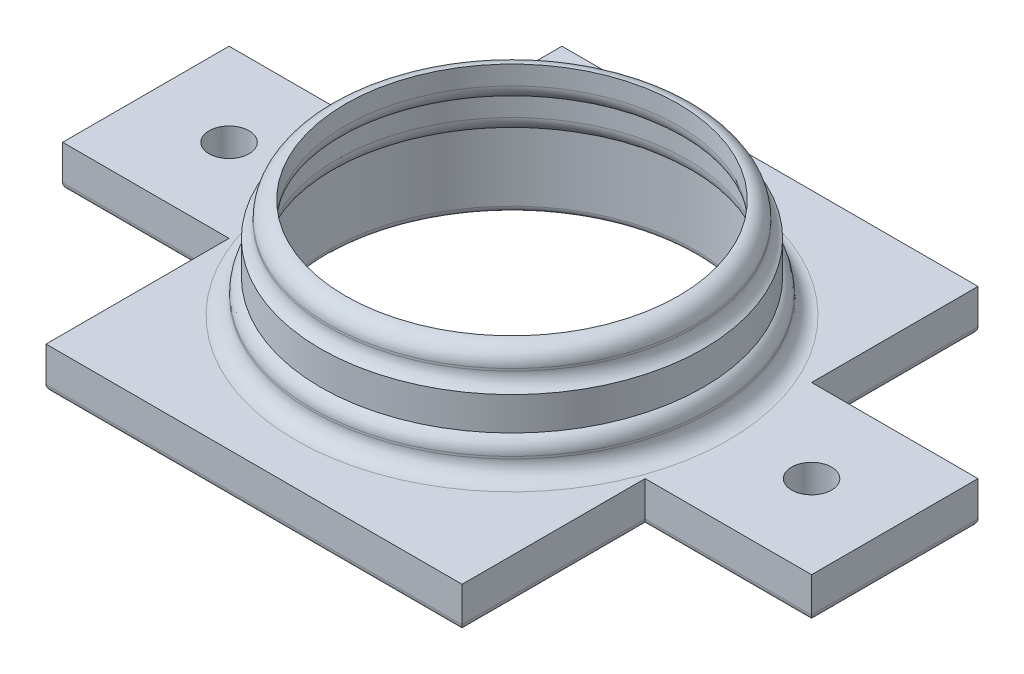
ISO-10303-21;
HEADER;
FILE_DESCRIPTION(('STEP AP214'),'2;1');
FILE_NAME('part.step','',(''),(''),'','','');
FILE_SCHEMA(('AUTOMOTIVE_DESIGN { 1 0 10303 214 1 1 1 1 }'));
ENDSEC;
DATA;
#1=APPLICATION_CONTEXT('core data for automotive mechanical design processes');
#2=APPLICATION_PROTOCOL_DEFINITION('international standard','automotive_design',2000,#1);
#3=PRODUCT_CONTEXT('',#1,'mechanical');
#4=PRODUCT('Part','Part','',(#3));
#5=PRODUCT_RELATED_PRODUCT_CATEGORY('part','',(#4));
#6=PRODUCT_DEFINITION_FORMATION('','',#4);
#7=PRODUCT_DEFINITION_CONTEXT('part definition',#1,'design');
#8=PRODUCT_DEFINITION('design','',#6,#7);
#9=PRODUCT_DEFINITION_SHAPE('','',#8);
#10=(LENGTH_UNIT() NAMED_UNIT(*) SI_UNIT(.MILLI.,.METRE.));
#11=(NAMED_UNIT(*) PLANE_ANGLE_UNIT() SI_UNIT($,.RADIAN.));
#12=(NAMED_UNIT(*) SI_UNIT($,.STERADIAN.) SOLID_ANGLE_UNIT());
#13=UNCERTAINTY_MEASURE_WITH_UNIT(LENGTH_MEASURE(1.E-05),#10,'distance_accuracy_value','');
#14=(GEOMETRIC_REPRESENTATION_CONTEXT(3) GLOBAL_UNCERTAINTY_ASSIGNED_CONTEXT((#13)) GLOBAL_UNIT_ASSIGNED_CONTEXT((#10,
#11,#12)) REPRESENTATION_CONTEXT('',''));
#15=CARTESIAN_POINT('',(0.,0.,0.));
#16=DIRECTION('',(0.,0.,1.));
#17=DIRECTION('',(1.,0.,0.));
#18=AXIS2_PLACEMENT_3D('',#15,#16,#17);
#19=CARTESIAN_POINT('',(0.,0.,0.));
#20=DIRECTION('',(0.,1.,0.));
#21=DIRECTION('',(0.,0.,1.));
#22=AXIS2_PLACEMENT_3D('',#19,#20,#21);
#23=PLANE('',#22);
#24=CARTESIAN_POINT('',(15.875,0.,-45.085));
#25=DIRECTION('',(0.,1.,0.));
#26=DIRECTION('',(0.,0.,1.));
#27=AXIS2_PLACEMENT_3D('',#24,#25,#26);
#28=CIRCLE('',#27,16.51);
#29=CARTESIAN_POINT('',(15.875,0.,-28.575));
#30=VERTEX_POINT('',#29);
#31=EDGE_CURVE('E343',#30,#30,#28,.F.);
#32=ORIENTED_EDGE('',*,*,#31,.T.);
#33=EDGE_LOOP('',(#32));
#34=FACE_BOUND('',#33,.T.);
#35=DIRECTION('',(0.,0.,1.));
#36=VECTOR('',#35,1.);
#37=CARTESIAN_POINT('',(0.,0.,-25.4));
#38=LINE('',#37,#36);
#39=CARTESIAN_POINT('',(0.,0.,-39.37));
#40=VERTEX_POINT('',#39);
#41=CARTESIAN_POINT('',(0.,0.,-25.4));
#42=VERTEX_POINT('',#41);
#43=EDGE_CURVE('E163',#40,#42,#38,.T.);
#44=ORIENTED_EDGE('',*,*,#43,.T.);
#45=DIRECTION('',(1.,0.,0.));
#46=VECTOR('',#45,1.);
#47=CARTESIAN_POINT('',(0.,0.,-25.4));
#48=LINE('',#47,#46);
#49=CARTESIAN_POINT('',(31.75,0.,-25.4));
#50=VERTEX_POINT('',#49);
#51=EDGE_CURVE('E174',#42,#50,#48,.T.);
#52=ORIENTED_EDGE('',*,*,#51,.T.);
#53=DIRECTION('',(0.,0.,-1.));
#54=VECTOR('',#53,1.);
#55=CARTESIAN_POINT('',(31.75,0.,-25.4));
#56=LINE('',#55,#54);
#57=CARTESIAN_POINT('',(31.75,0.,-39.37));
#58=VERTEX_POINT('',#57);
#59=EDGE_CURVE('E180',#50,#58,#56,.T.);
#60=ORIENTED_EDGE('',*,*,#59,.T.);
#61=DIRECTION('',(1.,0.,0.));
#62=VECTOR('',#61,1.);
#63=CARTESIAN_POINT('',(31.75,0.,-39.37));
#64=LINE('',#63,#62);
#65=CARTESIAN_POINT('',(44.45,0.,-39.37));
#66=VERTEX_POINT('',#65);
#67=EDGE_CURVE('E193',#58,#66,#64,.T.);
#68=ORIENTED_EDGE('',*,*,#67,.T.);
#69=DIRECTION('',(0.,0.,-1.));
#70=VECTOR('',#69,1.);
#71=CARTESIAN_POINT('',(44.45,0.,-52.07));
#72=LINE('',#71,#70);
#73=CARTESIAN_POINT('',(44.45,0.,-52.07));
#74=VERTEX_POINT('',#73);
#75=EDGE_CURVE('E196',#66,#74,#72,.T.);
#76=ORIENTED_EDGE('',*,*,#75,.T.);
#77=DIRECTION('',(-1.,0.,0.));
#78=VECTOR('',#77,1.);
#79=CARTESIAN_POINT('',(31.75,0.,-52.07));
#80=LINE('',#79,#78);
#81=CARTESIAN_POINT('',(31.75,0.,-52.07));
#82=VERTEX_POINT('',#81);
#83=EDGE_CURVE('E199',#74,#82,#80,.T.);
#84=ORIENTED_EDGE('',*,*,#83,.T.);
#85=DIRECTION('',(0.,0.,-1.));
#86=VECTOR('',#85,1.);
#87=CARTESIAN_POINT('',(31.75,0.,-52.07));
#88=LINE('',#87,#86);
#89=CARTESIAN_POINT('',(31.75,0.,-64.77));
#90=VERTEX_POINT('',#89);
#91=EDGE_CURVE('E202',#82,#90,#88,.T.);
#92=ORIENTED_EDGE('',*,*,#91,.T.);
#93=DIRECTION('',(-1.,0.,0.));
#94=VECTOR('',#93,1.);
#95=CARTESIAN_POINT('',(0.,0.,-64.77));
#96=LINE('',#95,#94);
#97=CARTESIAN_POINT('',(0.,0.,-64.77));
#98=VERTEX_POINT('',#97);
#99=EDGE_CURVE('E205',#90,#98,#96,.T.);
#100=ORIENTED_EDGE('',*,*,#99,.T.);
#101=DIRECTION('',(0.,0.,1.));
#102=VECTOR('',#101,1.);
#103=CARTESIAN_POINT('',(0.,0.,-52.07));
#104=LINE('',#103,#102);
#105=CARTESIAN_POINT('',(0.,0.,-52.07));
#106=VERTEX_POINT('',#105);
#107=EDGE_CURVE('E208',#98,#106,#104,.T.);
#108=ORIENTED_EDGE('',*,*,#107,.T.);
#109=DIRECTION('',(-1.,0.,0.));
#110=VECTOR('',#109,1.);
#111=CARTESIAN_POINT('',(0.,0.,-52.07));
#112=LINE('',#111,#110);
#113=CARTESIAN_POINT('',(-12.7,0.,-52.07));
#114=VERTEX_POINT('',#113);
#115=EDGE_CURVE('E211',#106,#114,#112,.T.);
#116=ORIENTED_EDGE('',*,*,#115,.T.);
#117=DIRECTION('',(0.,0.,1.));
#118=VECTOR('',#117,1.);
#119=CARTESIAN_POINT('',(-12.7,0.,-52.07));
#120=LINE('',#119,#118);
#121=CARTESIAN_POINT('',(-12.7,0.,-39.37));
#122=VERTEX_POINT('',#121);
#123=EDGE_CURVE('E214',#114,#122,#120,.T.);
#124=ORIENTED_EDGE('',*,*,#123,.T.);
#125=DIRECTION('',(1.,0.,0.));
#126=VECTOR('',#125,1.);
#127=CARTESIAN_POINT('',(0.,0.,-39.37));
#128=LINE('',#127,#126);
#129=EDGE_CURVE('E171',#122,#40,#128,.T.);
#130=ORIENTED_EDGE('',*,*,#129,.T.);
#131=EDGE_LOOP('',(#44,#52,#60,#68,#76,#84,#92,#100,#108,#116,#124,#130));
#132=FACE_BOUND('',#131,.T.);
#133=CARTESIAN_POINT('',(-6.35,0.,-45.72));
#134=DIRECTION('',(0.,1.,0.));
#135=DIRECTION('',(0.,0.,1.));
#136=AXIS2_PLACEMENT_3D('',#133,#134,#135);
#137=CIRCLE('',#136,1.524);
#138=CARTESIAN_POINT('',(-6.35,0.,-44.196));
#139=VERTEX_POINT('',#138);
#140=EDGE_CURVE('E185',#139,#139,#137,.T.);
#141=ORIENTED_EDGE('',*,*,#140,.F.);
#142=EDGE_LOOP('',(#141));
#143=FACE_BOUND('',#142,.T.);
#144=CARTESIAN_POINT('',(38.1,0.,-45.72));
#145=DIRECTION('',(0.,1.,0.));
#146=DIRECTION('',(0.,0.,1.));
#147=AXIS2_PLACEMENT_3D('',#144,#145,#146);
#148=CIRCLE('',#147,1.524);
#149=CARTESIAN_POINT('',(38.1,0.,-44.196));
#150=VERTEX_POINT('',#149);
#151=EDGE_CURVE('E188',#150,#150,#148,.T.);
#152=ORIENTED_EDGE('',*,*,#151,.F.);
#153=EDGE_LOOP('',(#152));
#154=FACE_BOUND('',#153,.T.);
#155=ADVANCED_FACE('F33',(#34,#132,#143,#154),#23,.T.);
#156=CARTESIAN_POINT('',(0.,-3.175,-25.4));
#157=DIRECTION('',(-1.,0.,0.));
#158=DIRECTION('',(0.,0.,1.));
#159=AXIS2_PLACEMENT_3D('',#156,#157,#158);
#160=PLANE('',#159);
#161=DIRECTION('',(0.,1.,0.));
#162=VECTOR('',#161,1.);
#163=CARTESIAN_POINT('',(0.,-3.175,-39.37));
#164=LINE('',#163,#162);
#165=CARTESIAN_POINT('',(0.,-2.667,-39.37));
#166=VERTEX_POINT('',#165);
#167=EDGE_CURVE('E217',#166,#40,#164,.T.);
#168=ORIENTED_EDGE('',*,*,#167,.F.);
#169=DIRECTION('',(0.,0.,1.));
#170=VECTOR('',#169,1.);
#171=CARTESIAN_POINT('',(0.,-2.667,-25.4));
#172=LINE('',#171,#170);
#173=CARTESIAN_POINT('',(0.,-2.667,-25.4));
#174=VERTEX_POINT('',#173);
#175=EDGE_CURVE('E166',#166,#174,#172,.T.);
#176=ORIENTED_EDGE('',*,*,#175,.T.);
#177=DIRECTION('',(0.,1.,0.));
#178=VECTOR('',#177,1.);
#179=CARTESIAN_POINT('',(0.,-3.175,-25.4));
#180=LINE('',#179,#178);
#181=EDGE_CURVE('E159',#174,#42,#180,.T.);
#182=ORIENTED_EDGE('',*,*,#181,.T.);
#183=ORIENTED_EDGE('',*,*,#43,.F.);
#184=EDGE_LOOP('',(#168,#176,#182,#183));
#185=FACE_BOUND('',#184,.T.);
#186=ADVANCED_FACE('F161',(#185),#160,.T.);
#187=CARTESIAN_POINT('',(0.,-3.175,-39.37));
#188=DIRECTION('',(0.,0.,1.));
#189=DIRECTION('',(1.,0.,0.));
#190=AXIS2_PLACEMENT_3D('',#187,#188,#189);
#191=PLANE('',#190);
#192=DIRECTION('',(0.,1.,0.));
#193=VECTOR('',#192,1.);
#194=CARTESIAN_POINT('',(-12.7,-3.175,-39.37));
#195=LINE('',#194,#193);
#196=CARTESIAN_POINT('',(-12.7,-2.667,-39.37));
#197=VERTEX_POINT('',#196);
#198=EDGE_CURVE('E220',#197,#122,#195,.T.);
#199=ORIENTED_EDGE('',*,*,#198,.F.);
#200=DIRECTION('',(1.,0.,0.));
#201=VECTOR('',#200,1.);
#202=CARTESIAN_POINT('',(0.,-2.667,-39.37));
#203=LINE('',#202,#201);
#204=EDGE_CURVE('E48',#197,#166,#203,.T.);
#205=ORIENTED_EDGE('',*,*,#204,.T.);
#206=ORIENTED_EDGE('',*,*,#167,.T.);
#207=ORIENTED_EDGE('',*,*,#129,.F.);
#208=EDGE_LOOP('',(#199,#205,#206,#207));
#209=FACE_BOUND('',#208,.T.);
#210=ADVANCED_FACE('F381',(#209),#191,.T.);
#211=CARTESIAN_POINT('',(-12.7,-3.175,-52.07));
#212=DIRECTION('',(-1.,0.,0.));
#213=DIRECTION('',(0.,0.,1.));
#214=AXIS2_PLACEMENT_3D('',#211,#212,#213);
#215=PLANE('',#214);
#216=DIRECTION('',(0.,1.,0.));
#217=VECTOR('',#216,1.);
#218=CARTESIAN_POINT('',(-12.7,-3.175,-52.07));
#219=LINE('',#218,#217);
#220=CARTESIAN_POINT('',(-12.7,-2.667,-52.07));
#221=VERTEX_POINT('',#220);
#222=EDGE_CURVE('E222',#221,#114,#219,.T.);
#223=ORIENTED_EDGE('',*,*,#222,.F.);
#224=DIRECTION('',(0.,0.,1.));
#225=VECTOR('',#224,1.);
#226=CARTESIAN_POINT('',(-12.7,-2.667,-39.37));
#227=LINE('',#226,#225);
#228=EDGE_CURVE('E56',#221,#197,#227,.T.);
#229=ORIENTED_EDGE('',*,*,#228,.T.);
#230=ORIENTED_EDGE('',*,*,#198,.T.);
#231=ORIENTED_EDGE('',*,*,#123,.F.);
#232=EDGE_LOOP('',(#223,#229,#230,#231));
#233=FACE_BOUND('',#232,.T.);
#234=ADVANCED_FACE('F389',(#233),#215,.T.);
#235=CARTESIAN_POINT('',(0.,-3.175,-52.07));
#236=DIRECTION('',(0.,0.,-1.));
#237=DIRECTION('',(-1.,0.,0.));
#238=AXIS2_PLACEMENT_3D('',#235,#236,#237);
#239=PLANE('',#238);
#240=DIRECTION('',(0.,1.,0.));
#241=VECTOR('',#240,1.);
#242=CARTESIAN_POINT('',(0.,-3.175,-52.07));
#243=LINE('',#242,#241);
#244=CARTESIAN_POINT('',(0.,-2.667,-52.07));
#245=VERTEX_POINT('',#244);
#246=EDGE_CURVE('E224',#245,#106,#243,.T.);
#247=ORIENTED_EDGE('',*,*,#246,.F.);
#248=DIRECTION('',(-1.,0.,0.));
#249=VECTOR('',#248,1.);
#250=CARTESIAN_POINT('',(-12.7,-2.667,-52.07));
#251=LINE('',#250,#249);
#252=EDGE_CURVE('E288',#245,#221,#251,.T.);
#253=ORIENTED_EDGE('',*,*,#252,.T.);
#254=ORIENTED_EDGE('',*,*,#222,.T.);
#255=ORIENTED_EDGE('',*,*,#115,.F.);
#256=EDGE_LOOP('',(#247,#253,#254,#255));
#257=FACE_BOUND('',#256,.T.);
#258=ADVANCED_FACE('F392',(#257),#239,.T.);
#259=CARTESIAN_POINT('',(0.,-3.175,-52.07));
#260=DIRECTION('',(-1.,0.,0.));
#261=DIRECTION('',(0.,0.,1.));
#262=AXIS2_PLACEMENT_3D('',#259,#260,#261);
#263=PLANE('',#262);
#264=DIRECTION('',(0.,1.,0.));
#265=VECTOR('',#264,1.);
#266=CARTESIAN_POINT('',(0.,-3.175,-64.77));
#267=LINE('',#266,#265);
#268=CARTESIAN_POINT('',(0.,-2.667,-64.77));
#269=VERTEX_POINT('',#268);
#270=EDGE_CURVE('E226',#269,#98,#267,.T.);
#271=ORIENTED_EDGE('',*,*,#270,.F.);
#272=DIRECTION('',(0.,0.,1.));
#273=VECTOR('',#272,1.);
#274=CARTESIAN_POINT('',(0.,-2.667,-52.07));
#275=LINE('',#274,#273);
#276=EDGE_CURVE('E286',#269,#245,#275,.T.);
#277=ORIENTED_EDGE('',*,*,#276,.T.);
#278=ORIENTED_EDGE('',*,*,#246,.T.);
#279=ORIENTED_EDGE('',*,*,#107,.F.);
#280=EDGE_LOOP('',(#271,#277,#278,#279));
#281=FACE_BOUND('',#280,.T.);
#282=ADVANCED_FACE('F395',(#281),#263,.T.);
#283=CARTESIAN_POINT('',(0.,-3.175,-64.77));
#284=DIRECTION('',(0.,0.,-1.));
#285=DIRECTION('',(-1.,0.,0.));
#286=AXIS2_PLACEMENT_3D('',#283,#284,#285);
#287=PLANE('',#286);
#288=DIRECTION('',(0.,1.,0.));
#289=VECTOR('',#288,1.);
#290=CARTESIAN_POINT('',(31.75,-3.175,-64.77));
#291=LINE('',#290,#289);
#292=CARTESIAN_POINT('',(31.75,-2.667,-64.77));
#293=VERTEX_POINT('',#292);
#294=EDGE_CURVE('E228',#293,#90,#291,.T.);
#295=ORIENTED_EDGE('',*,*,#294,.F.);
#296=DIRECTION('',(-1.,0.,0.));
#297=VECTOR('',#296,1.);
#298=CARTESIAN_POINT('',(0.,-2.667,-64.77));
#299=LINE('',#298,#297);
#300=EDGE_CURVE('E284',#293,#269,#299,.T.);
#301=ORIENTED_EDGE('',*,*,#300,.T.);
#302=ORIENTED_EDGE('',*,*,#270,.T.);
#303=ORIENTED_EDGE('',*,*,#99,.F.);
#304=EDGE_LOOP('',(#295,#301,#302,#303));
#305=FACE_BOUND('',#304,.T.);
#306=ADVANCED_FACE('F399',(#305),#287,.T.);
#307=CARTESIAN_POINT('',(31.75,-3.175,-52.07));
#308=DIRECTION('',(1.,0.,0.));
#309=DIRECTION('',(0.,0.,-1.));
#310=AXIS2_PLACEMENT_3D('',#307,#308,#309);
#311=PLANE('',#310);
#312=DIRECTION('',(0.,1.,0.));
#313=VECTOR('',#312,1.);
#314=CARTESIAN_POINT('',(31.75,-3.175,-52.07));
#315=LINE('',#314,#313);
#316=CARTESIAN_POINT('',(31.75,-2.667,-52.07));
#317=VERTEX_POINT('',#316);
#318=EDGE_CURVE('E230',#317,#82,#315,.T.);
#319=ORIENTED_EDGE('',*,*,#318,.F.);
#320=DIRECTION('',(0.,0.,-1.));
#321=VECTOR('',#320,1.);
#322=CARTESIAN_POINT('',(31.75,-2.667,-64.77));
#323=LINE('',#322,#321);
#324=EDGE_CURVE('E282',#317,#293,#323,.T.);
#325=ORIENTED_EDGE('',*,*,#324,.T.);
#326=ORIENTED_EDGE('',*,*,#294,.T.);
#327=ORIENTED_EDGE('',*,*,#91,.F.);
#328=EDGE_LOOP('',(#319,#325,#326,#327));
#329=FACE_BOUND('',#328,.T.);
#330=ADVANCED_FACE('F403',(#329),#311,.T.);
#331=CARTESIAN_POINT('',(31.75,-3.175,-52.07));
#332=DIRECTION('',(0.,0.,-1.));
#333=DIRECTION('',(-1.,0.,0.));
#334=AXIS2_PLACEMENT_3D('',#331,#332,#333);
#335=PLANE('',#334);
#336=DIRECTION('',(0.,1.,0.));
#337=VECTOR('',#336,1.);
#338=CARTESIAN_POINT('',(44.45,-3.175,-52.07));
#339=LINE('',#338,#337);
#340=CARTESIAN_POINT('',(44.45,-2.667,-52.07));
#341=VERTEX_POINT('',#340);
#342=EDGE_CURVE('E232',#341,#74,#339,.T.);
#343=ORIENTED_EDGE('',*,*,#342,.F.);
#344=DIRECTION('',(-1.,0.,0.));
#345=VECTOR('',#344,1.);
#346=CARTESIAN_POINT('',(31.75,-2.667,-52.07));
#347=LINE('',#346,#345);
#348=EDGE_CURVE('E280',#341,#317,#347,.T.);
#349=ORIENTED_EDGE('',*,*,#348,.T.);
#350=ORIENTED_EDGE('',*,*,#318,.T.);
#351=ORIENTED_EDGE('',*,*,#83,.F.);
#352=EDGE_LOOP('',(#343,#349,#350,#351));
#353=FACE_BOUND('',#352,.T.);
#354=ADVANCED_FACE('F407',(#353),#335,.T.);
#355=CARTESIAN_POINT('',(44.45,-3.175,-52.07));
#356=DIRECTION('',(1.,0.,0.));
#357=DIRECTION('',(0.,0.,-1.));
#358=AXIS2_PLACEMENT_3D('',#355,#356,#357);
#359=PLANE('',#358);
#360=DIRECTION('',(0.,1.,0.));
#361=VECTOR('',#360,1.);
#362=CARTESIAN_POINT('',(44.45,-3.175,-39.37));
#363=LINE('',#362,#361);
#364=CARTESIAN_POINT('',(44.45,-2.667,-39.37));
#365=VERTEX_POINT('',#364);
#366=EDGE_CURVE('E234',#365,#66,#363,.T.);
#367=ORIENTED_EDGE('',*,*,#366,.F.);
#368=DIRECTION('',(0.,0.,-1.));
#369=VECTOR('',#368,1.);
#370=CARTESIAN_POINT('',(44.45,-2.667,-52.07));
#371=LINE('',#370,#369);
#372=EDGE_CURVE('E278',#365,#341,#371,.T.);
#373=ORIENTED_EDGE('',*,*,#372,.T.);
#374=ORIENTED_EDGE('',*,*,#342,.T.);
#375=ORIENTED_EDGE('',*,*,#75,.F.);
#376=EDGE_LOOP('',(#367,#373,#374,#375));
#377=FACE_BOUND('',#376,.T.);
#378=ADVANCED_FACE('F411',(#377),#359,.T.);
#379=CARTESIAN_POINT('',(31.75,-3.175,-39.37));
#380=DIRECTION('',(0.,0.,1.));
#381=DIRECTION('',(1.,0.,0.));
#382=AXIS2_PLACEMENT_3D('',#379,#380,#381);
#383=PLANE('',#382);
#384=DIRECTION('',(0.,1.,0.));
#385=VECTOR('',#384,1.);
#386=CARTESIAN_POINT('',(31.75,-3.175,-39.37));
#387=LINE('',#386,#385);
#388=CARTESIAN_POINT('',(31.75,-2.667,-39.37));
#389=VERTEX_POINT('',#388);
#390=EDGE_CURVE('E236',#389,#58,#387,.T.);
#391=ORIENTED_EDGE('',*,*,#390,.F.);
#392=DIRECTION('',(1.,0.,0.));
#393=VECTOR('',#392,1.);
#394=CARTESIAN_POINT('',(44.45,-2.667,-39.37));
#395=LINE('',#394,#393);
#396=EDGE_CURVE('E276',#389,#365,#395,.T.);
#397=ORIENTED_EDGE('',*,*,#396,.T.);
#398=ORIENTED_EDGE('',*,*,#366,.T.);
#399=ORIENTED_EDGE('',*,*,#67,.F.);
#400=EDGE_LOOP('',(#391,#397,#398,#399));
#401=FACE_BOUND('',#400,.T.);
#402=ADVANCED_FACE('F415',(#401),#383,.T.);
#403=CARTESIAN_POINT('',(31.75,-3.175,-25.4));
#404=DIRECTION('',(1.,0.,0.));
#405=DIRECTION('',(0.,0.,-1.));
#406=AXIS2_PLACEMENT_3D('',#403,#404,#405);
#407=PLANE('',#406);
#408=DIRECTION('',(0.,1.,0.));
#409=VECTOR('',#408,1.);
#410=CARTESIAN_POINT('',(31.75,-3.175,-25.4));
#411=LINE('',#410,#409);
#412=CARTESIAN_POINT('',(31.75,-2.667,-25.4));
#413=VERTEX_POINT('',#412);
#414=EDGE_CURVE('E170',#413,#50,#411,.T.);
#415=ORIENTED_EDGE('',*,*,#414,.F.);
#416=DIRECTION('',(0.,0.,-1.));
#417=VECTOR('',#416,1.);
#418=CARTESIAN_POINT('',(31.75,-2.667,-39.37));
#419=LINE('',#418,#417);
#420=EDGE_CURVE('E274',#413,#389,#419,.T.);
#421=ORIENTED_EDGE('',*,*,#420,.T.);
#422=ORIENTED_EDGE('',*,*,#390,.T.);
#423=ORIENTED_EDGE('',*,*,#59,.F.);
#424=EDGE_LOOP('',(#415,#421,#422,#423));
#425=FACE_BOUND('',#424,.T.);
#426=ADVANCED_FACE('F419',(#425),#407,.T.);
#427=CARTESIAN_POINT('',(0.,-3.175,-25.4));
#428=DIRECTION('',(0.,0.,1.));
#429=DIRECTION('',(1.,0.,0.));
#430=AXIS2_PLACEMENT_3D('',#427,#428,#429);
#431=PLANE('',#430);
#432=ORIENTED_EDGE('',*,*,#181,.F.);
#433=DIRECTION('',(1.,0.,0.));
#434=VECTOR('',#433,1.);
#435=CARTESIAN_POINT('',(31.75,-2.667,-25.4));
#436=LINE('',#435,#434);
#437=EDGE_CURVE('E219',#174,#413,#436,.T.);
#438=ORIENTED_EDGE('',*,*,#437,.T.);
#439=ORIENTED_EDGE('',*,*,#414,.T.);
#440=ORIENTED_EDGE('',*,*,#51,.F.);
#441=EDGE_LOOP('',(#432,#438,#439,#440));
#442=FACE_BOUND('',#441,.T.);
#443=ADVANCED_FACE('F175',(#442),#431,.T.);
#444=CARTESIAN_POINT('',(0.,-3.175,0.));
#445=DIRECTION('',(0.,1.,0.));
#446=DIRECTION('',(0.,0.,1.));
#447=AXIS2_PLACEMENT_3D('',#444,#445,#446);
#448=PLANE('',#447);
#449=DIRECTION('',(0.,0.,-1.));
#450=VECTOR('',#449,1.);
#451=CARTESIAN_POINT('',(31.242,-3.175,-25.4));
#452=LINE('',#451,#450);
#453=CARTESIAN_POINT('',(31.242,-3.175,-39.878));
#454=VERTEX_POINT('',#453);
#455=CARTESIAN_POINT('',(31.242,-3.175,-25.908));
#456=VERTEX_POINT('',#455);
#457=EDGE_CURVE('E269',#454,#456,#452,.F.);
#458=ORIENTED_EDGE('',*,*,#457,.T.);
#459=DIRECTION('',(1.,0.,0.));
#460=VECTOR('',#459,1.);
#461=CARTESIAN_POINT('',(0.,-3.175,-25.908));
#462=LINE('',#461,#460);
#463=CARTESIAN_POINT('',(0.508,-3.175,-25.908));
#464=VERTEX_POINT('',#463);
#465=EDGE_CURVE('E271',#456,#464,#462,.F.);
#466=ORIENTED_EDGE('',*,*,#465,.T.);
#467=DIRECTION('',(0.,0.,1.));
#468=VECTOR('',#467,1.);
#469=CARTESIAN_POINT('',(0.508,-3.175,-39.37));
#470=LINE('',#469,#468);
#471=CARTESIAN_POINT('',(0.508,-3.175,-39.878));
#472=VERTEX_POINT('',#471);
#473=EDGE_CURVE('E249',#464,#472,#470,.F.);
#474=ORIENTED_EDGE('',*,*,#473,.T.);
#475=DIRECTION('',(1.,0.,0.));
#476=VECTOR('',#475,1.);
#477=CARTESIAN_POINT('',(-12.7,-3.175,-39.878));
#478=LINE('',#477,#476);
#479=CARTESIAN_POINT('',(-12.192,-3.175,-39.878));
#480=VERTEX_POINT('',#479);
#481=EDGE_CURVE('E251',#472,#480,#478,.F.);
#482=ORIENTED_EDGE('',*,*,#481,.T.);
#483=DIRECTION('',(0.,0.,1.));
#484=VECTOR('',#483,1.);
#485=CARTESIAN_POINT('',(-12.192,-3.175,-52.07));
#486=LINE('',#485,#484);
#487=CARTESIAN_POINT('',(-12.192,-3.175,-51.562));
#488=VERTEX_POINT('',#487);
#489=EDGE_CURVE('E253',#480,#488,#486,.F.);
#490=ORIENTED_EDGE('',*,*,#489,.T.);
#491=DIRECTION('',(-1.,0.,0.));
#492=VECTOR('',#491,1.);
#493=CARTESIAN_POINT('',(0.,-3.175,-51.562));
#494=LINE('',#493,#492);
#495=CARTESIAN_POINT('',(0.508,-3.175,-51.562));
#496=VERTEX_POINT('',#495);
#497=EDGE_CURVE('E255',#488,#496,#494,.F.);
#498=ORIENTED_EDGE('',*,*,#497,.T.);
#499=DIRECTION('',(0.,0.,1.));
#500=VECTOR('',#499,1.);
#501=CARTESIAN_POINT('',(0.508,-3.175,-64.77));
#502=LINE('',#501,#500);
#503=CARTESIAN_POINT('',(0.508,-3.175,-64.262));
#504=VERTEX_POINT('',#503);
#505=EDGE_CURVE('E257',#496,#504,#502,.F.);
#506=ORIENTED_EDGE('',*,*,#505,.T.);
#507=DIRECTION('',(-1.,0.,0.));
#508=VECTOR('',#507,1.);
#509=CARTESIAN_POINT('',(31.75,-3.175,-64.262));
#510=LINE('',#509,#508);
#511=CARTESIAN_POINT('',(31.242,-3.175,-64.262));
#512=VERTEX_POINT('',#511);
#513=EDGE_CURVE('E259',#504,#512,#510,.F.);
#514=ORIENTED_EDGE('',*,*,#513,.T.);
#515=DIRECTION('',(0.,0.,-1.));
#516=VECTOR('',#515,1.);
#517=CARTESIAN_POINT('',(31.242,-3.175,-52.07));
#518=LINE('',#517,#516);
#519=CARTESIAN_POINT('',(31.242,-3.175,-51.562));
#520=VERTEX_POINT('',#519);
#521=EDGE_CURVE('E261',#512,#520,#518,.F.);
#522=ORIENTED_EDGE('',*,*,#521,.T.);
#523=DIRECTION('',(-1.,0.,0.));
#524=VECTOR('',#523,1.);
#525=CARTESIAN_POINT('',(44.45,-3.175,-51.562));
#526=LINE('',#525,#524);
#527=CARTESIAN_POINT('',(43.942,-3.175,-51.562));
#528=VERTEX_POINT('',#527);
#529=EDGE_CURVE('E263',#520,#528,#526,.F.);
#530=ORIENTED_EDGE('',*,*,#529,.T.);
#531=DIRECTION('',(0.,0.,-1.));
#532=VECTOR('',#531,1.);
#533=CARTESIAN_POINT('',(43.942,-3.175,-39.37));
#534=LINE('',#533,#532);
#535=CARTESIAN_POINT('',(43.942,-3.175,-39.878));
#536=VERTEX_POINT('',#535);
#537=EDGE_CURVE('E265',#528,#536,#534,.F.);
#538=ORIENTED_EDGE('',*,*,#537,.T.);
#539=DIRECTION('',(1.,0.,0.));
#540=VECTOR('',#539,1.);
#541=CARTESIAN_POINT('',(31.75,-3.175,-39.878));
#542=LINE('',#541,#540);
#543=EDGE_CURVE('E267',#536,#454,#542,.F.);
#544=ORIENTED_EDGE('',*,*,#543,.T.);
#545=EDGE_LOOP('',(#458,#466,#474,#482,#490,#498,#506,#514,#522,#530,#538,#544));
#546=FACE_BOUND('',#545,.T.);
#547=CARTESIAN_POINT('',(-6.35,-3.175,-45.72));
#548=DIRECTION('',(0.,1.,0.));
#549=DIRECTION('',(0.,0.,1.));
#550=AXIS2_PLACEMENT_3D('',#547,#548,#549);
#551=CIRCLE('',#550,2.032);
#552=CARTESIAN_POINT('',(-6.35,-3.175,-43.688));
#553=VERTEX_POINT('',#552);
#554=EDGE_CURVE('E246',#553,#553,#551,.T.);
#555=ORIENTED_EDGE('',*,*,#554,.T.);
#556=EDGE_LOOP('',(#555));
#557=FACE_BOUND('',#556,.T.);
#558=CARTESIAN_POINT('',(38.1,-3.175,-45.72));
#559=DIRECTION('',(0.,1.,0.));
#560=DIRECTION('',(0.,0.,1.));
#561=AXIS2_PLACEMENT_3D('',#558,#559,#560);
#562=CIRCLE('',#561,2.032);
#563=CARTESIAN_POINT('',(38.1,-3.175,-43.688));
#564=VERTEX_POINT('',#563);
#565=EDGE_CURVE('E243',#564,#564,#562,.T.);
#566=ORIENTED_EDGE('',*,*,#565,.T.);
#567=EDGE_LOOP('',(#566));
#568=FACE_BOUND('',#567,.T.);
#569=CARTESIAN_POINT('',(15.875,-3.175,-45.085));
#570=DIRECTION('',(0.,1.,0.));
#571=DIRECTION('',(0.,0.,1.));
#572=AXIS2_PLACEMENT_3D('',#569,#570,#571);
#573=CIRCLE('',#572,14.478);
#574=CARTESIAN_POINT('',(15.875,-3.175,-30.607));
#575=VERTEX_POINT('',#574);
#576=EDGE_CURVE('E240',#575,#575,#573,.T.);
#577=ORIENTED_EDGE('',*,*,#576,.T.);
#578=EDGE_LOOP('',(#577));
#579=FACE_BOUND('',#578,.T.);
#580=ADVANCED_FACE('F385',(#546,#557,#568,#579),#448,.F.);
#581=CARTESIAN_POINT('',(-6.35,-3.175,-45.72));
#582=DIRECTION('',(0.,1.,0.));
#583=DIRECTION('',(0.,0.,1.));
#584=AXIS2_PLACEMENT_3D('',#581,#582,#583);
#585=CYLINDRICAL_SURFACE('',#584,1.524);
#586=CARTESIAN_POINT('',(-6.35,-2.667,-45.72));
#587=DIRECTION('',(0.,1.,0.));
#588=DIRECTION('',(0.,0.,1.));
#589=AXIS2_PLACEMENT_3D('',#586,#587,#588);
#590=CIRCLE('',#589,1.524);
#591=CARTESIAN_POINT('',(-6.35,-2.667,-44.196));
#592=VERTEX_POINT('',#591);
#593=EDGE_CURVE('E293',#592,#592,#590,.F.);
#594=ORIENTED_EDGE('',*,*,#593,.T.);
#595=EDGE_LOOP('',(#594));
#596=FACE_BOUND('',#595,.T.);
#597=ORIENTED_EDGE('',*,*,#140,.T.);
#598=EDGE_LOOP('',(#597));
#599=FACE_BOUND('',#598,.T.);
#600=ADVANCED_FACE('F539',(#596,#599),#585,.F.);
#601=CARTESIAN_POINT('',(38.1,-3.175,-45.72));
#602=DIRECTION('',(0.,1.,0.));
#603=DIRECTION('',(0.,0.,1.));
#604=AXIS2_PLACEMENT_3D('',#601,#602,#603);
#605=CYLINDRICAL_SURFACE('',#604,1.524);
#606=CARTESIAN_POINT('',(38.1,-2.667,-45.72));
#607=DIRECTION('',(0.,1.,0.));
#608=DIRECTION('',(0.,0.,1.));
#609=AXIS2_PLACEMENT_3D('',#606,#607,#608);
#610=CIRCLE('',#609,1.524);
#611=CARTESIAN_POINT('',(38.1,-2.667,-44.196));
#612=VERTEX_POINT('',#611);
#613=EDGE_CURVE('E296',#612,#612,#610,.F.);
#614=ORIENTED_EDGE('',*,*,#613,.T.);
#615=EDGE_LOOP('',(#614));
#616=FACE_BOUND('',#615,.T.);
#617=ORIENTED_EDGE('',*,*,#151,.T.);
#618=EDGE_LOOP('',(#617));
#619=FACE_BOUND('',#618,.T.);
#620=ADVANCED_FACE('F373',(#616,#619),#605,.F.);
#621=CARTESIAN_POINT('',(15.875,-3.175,-45.085));
#622=DIRECTION('',(0.,1.,0.));
#623=DIRECTION('',(0.,0.,1.));
#624=AXIS2_PLACEMENT_3D('',#621,#622,#623);
#625=CYLINDRICAL_SURFACE('',#624,13.97);
#626=CARTESIAN_POINT('',(15.875,-2.667,-45.085));
#627=DIRECTION('',(0.,1.,0.));
#628=DIRECTION('',(0.,0.,1.));
#629=AXIS2_PLACEMENT_3D('',#626,#627,#628);
#630=CIRCLE('',#629,13.97);
#631=CARTESIAN_POINT('',(15.875,-2.667,-31.115));
#632=VERTEX_POINT('',#631);
#633=EDGE_CURVE('E299',#632,#632,#630,.F.);
#634=ORIENTED_EDGE('',*,*,#633,.T.);
#635=EDGE_LOOP('',(#634));
#636=FACE_BOUND('',#635,.T.);
#637=CARTESIAN_POINT('',(15.875,2.54,-45.085));
#638=DIRECTION('',(0.,1.,0.));
#639=DIRECTION('',(0.,0.,1.));
#640=AXIS2_PLACEMENT_3D('',#637,#638,#639);
#641=CIRCLE('',#640,13.97);
#642=CARTESIAN_POINT('',(15.875,2.54,-31.115));
#643=VERTEX_POINT('',#642);
#644=EDGE_CURVE('E306',#643,#643,#641,.F.);
#645=ORIENTED_EDGE('',*,*,#644,.F.);
#646=EDGE_LOOP('',(#645));
#647=FACE_BOUND('',#646,.T.);
#648=ADVANCED_FACE('F474',(#636,#647),#625,.F.);
#649=CARTESIAN_POINT('',(0.,-2.667,-64.262));
#650=DIRECTION('',(1.,0.,0.));
#651=DIRECTION('',(0.,0.,-1.));
#652=AXIS2_PLACEMENT_3D('',#649,#650,#651);
#653=CYLINDRICAL_SURFACE('',#652,0.508);
#654=CARTESIAN_POINT('',(31.242,-2.667,-64.262));
#655=DIRECTION('',(0.707106781186547,0.,0.707106781186547));
#656=DIRECTION('',(0.707106781186547,0.,-0.707106781186547));
#657=AXIS2_PLACEMENT_3D('',#654,#655,#656);
#658=ELLIPSE('',#657,0.718420489685532,0.508);
#659=EDGE_CURVE('E332',#512,#293,#658,.T.);
#660=ORIENTED_EDGE('',*,*,#659,.F.);
#661=ORIENTED_EDGE('',*,*,#513,.F.);
#662=CARTESIAN_POINT('',(0.508,-2.667,-64.262));
#663=DIRECTION('',(0.707106781186547,0.,-0.707106781186547));
#664=DIRECTION('',(-0.707106781186547,0.,-0.707106781186547));
#665=AXIS2_PLACEMENT_3D('',#662,#663,#664);
#666=ELLIPSE('',#665,0.718420489685532,0.508);
#667=EDGE_CURVE('E335',#269,#504,#666,.F.);
#668=ORIENTED_EDGE('',*,*,#667,.F.);
#669=ORIENTED_EDGE('',*,*,#300,.F.);
#670=EDGE_LOOP('',(#660,#661,#668,#669));
#671=FACE_BOUND('',#670,.T.);
#672=ADVANCED_FACE('F470',(#671),#653,.T.);
#673=CARTESIAN_POINT('',(0.508,-2.667,-52.07));
#674=DIRECTION('',(0.,0.,-1.));
#675=DIRECTION('',(-1.,0.,0.));
#676=AXIS2_PLACEMENT_3D('',#673,#674,#675);
#677=CYLINDRICAL_SURFACE('',#676,0.508);
#678=ORIENTED_EDGE('',*,*,#667,.T.);
#679=ORIENTED_EDGE('',*,*,#505,.F.);
#680=CARTESIAN_POINT('',(0.508,-2.667,-51.562));
#681=DIRECTION('',(0.707106781186547,0.,-0.707106781186547));
#682=DIRECTION('',(-0.707106781186547,0.,-0.707106781186547));
#683=AXIS2_PLACEMENT_3D('',#680,#681,#682);
#684=ELLIPSE('',#683,0.718420489685532,0.508);
#685=EDGE_CURVE('E329',#245,#496,#684,.F.);
#686=ORIENTED_EDGE('',*,*,#685,.F.);
#687=ORIENTED_EDGE('',*,*,#276,.F.);
#688=EDGE_LOOP('',(#678,#679,#686,#687));
#689=FACE_BOUND('',#688,.T.);
#690=ADVANCED_FACE('F466',(#689),#677,.T.);
#691=CARTESIAN_POINT('',(31.242,-2.667,-52.07));
#692=DIRECTION('',(0.,0.,1.));
#693=DIRECTION('',(1.,0.,0.));
#694=AXIS2_PLACEMENT_3D('',#691,#692,#693);
#695=CYLINDRICAL_SURFACE('',#694,0.508);
#696=ORIENTED_EDGE('',*,*,#659,.T.);
#697=ORIENTED_EDGE('',*,*,#324,.F.);
#698=CARTESIAN_POINT('',(31.242,-2.667,-51.562));
#699=DIRECTION('',(0.707106781186547,0.,0.707106781186547));
#700=DIRECTION('',(0.707106781186547,0.,-0.707106781186547));
#701=AXIS2_PLACEMENT_3D('',#698,#699,#700);
#702=ELLIPSE('',#701,0.718420489685532,0.508);
#703=EDGE_CURVE('E326',#520,#317,#702,.T.);
#704=ORIENTED_EDGE('',*,*,#703,.F.);
#705=ORIENTED_EDGE('',*,*,#521,.F.);
#706=EDGE_LOOP('',(#696,#697,#704,#705));
#707=FACE_BOUND('',#706,.T.);
#708=ADVANCED_FACE('F462',(#707),#695,.T.);
#709=CARTESIAN_POINT('',(0.,-2.667,-51.562));
#710=DIRECTION('',(1.,0.,0.));
#711=DIRECTION('',(0.,0.,-1.));
#712=AXIS2_PLACEMENT_3D('',#709,#710,#711);
#713=CYLINDRICAL_SURFACE('',#712,0.508);
#714=ORIENTED_EDGE('',*,*,#685,.T.);
#715=ORIENTED_EDGE('',*,*,#497,.F.);
#716=CARTESIAN_POINT('',(-12.192,-2.667,-51.562));
#717=DIRECTION('',(0.707106781186548,0.,-0.707106781186547));
#718=DIRECTION('',(-0.707106781186547,0.,-0.707106781186548));
#719=AXIS2_PLACEMENT_3D('',#716,#717,#718);
#720=ELLIPSE('',#719,0.718420489685532,0.508);
#721=EDGE_CURVE('E323',#221,#488,#720,.F.);
#722=ORIENTED_EDGE('',*,*,#721,.F.);
#723=ORIENTED_EDGE('',*,*,#252,.F.);
#724=EDGE_LOOP('',(#714,#715,#722,#723));
#725=FACE_BOUND('',#724,.T.);
#726=ADVANCED_FACE('F458',(#725),#713,.T.);
#727=CARTESIAN_POINT('',(31.75,-2.667,-51.562));
#728=DIRECTION('',(1.,0.,0.));
#729=DIRECTION('',(0.,0.,-1.));
#730=AXIS2_PLACEMENT_3D('',#727,#728,#729);
#731=CYLINDRICAL_SURFACE('',#730,0.508);
#732=ORIENTED_EDGE('',*,*,#703,.T.);
#733=ORIENTED_EDGE('',*,*,#348,.F.);
#734=CARTESIAN_POINT('',(43.942,-2.667,-51.562));
#735=DIRECTION('',(0.707106781186547,0.,0.707106781186547));
#736=DIRECTION('',(0.707106781186547,0.,-0.707106781186547));
#737=AXIS2_PLACEMENT_3D('',#734,#735,#736);
#738=ELLIPSE('',#737,0.718420489685532,0.508);
#739=EDGE_CURVE('E320',#528,#341,#738,.T.);
#740=ORIENTED_EDGE('',*,*,#739,.F.);
#741=ORIENTED_EDGE('',*,*,#529,.F.);
#742=EDGE_LOOP('',(#732,#733,#740,#741));
#743=FACE_BOUND('',#742,.T.);
#744=ADVANCED_FACE('F454',(#743),#731,.T.);
#745=CARTESIAN_POINT('',(-12.192,-2.667,-52.07));
#746=DIRECTION('',(0.,0.,-1.));
#747=DIRECTION('',(-1.,0.,0.));
#748=AXIS2_PLACEMENT_3D('',#745,#746,#747);
#749=CYLINDRICAL_SURFACE('',#748,0.508);
#750=ORIENTED_EDGE('',*,*,#721,.T.);
#751=ORIENTED_EDGE('',*,*,#489,.F.);
#752=CARTESIAN_POINT('',(-12.192,-2.667,-39.878));
#753=DIRECTION('',(-0.707106781186547,0.,-0.707106781186548));
#754=DIRECTION('',(-0.707106781186548,0.,0.707106781186547));
#755=AXIS2_PLACEMENT_3D('',#752,#753,#754);
#756=ELLIPSE('',#755,0.718420489685532,0.508);
#757=EDGE_CURVE('E317',#197,#480,#756,.F.);
#758=ORIENTED_EDGE('',*,*,#757,.F.);
#759=ORIENTED_EDGE('',*,*,#228,.F.);
#760=EDGE_LOOP('',(#750,#751,#758,#759));
#761=FACE_BOUND('',#760,.T.);
#762=ADVANCED_FACE('F450',(#761),#749,.T.);
#763=CARTESIAN_POINT('',(43.942,-2.667,-52.07));
#764=DIRECTION('',(0.,0.,1.));
#765=DIRECTION('',(1.,0.,0.));
#766=AXIS2_PLACEMENT_3D('',#763,#764,#765);
#767=CYLINDRICAL_SURFACE('',#766,0.508);
#768=ORIENTED_EDGE('',*,*,#739,.T.);
#769=ORIENTED_EDGE('',*,*,#372,.F.);
#770=CARTESIAN_POINT('',(43.942,-2.667,-39.878));
#771=DIRECTION('',(-0.707106781186547,0.,0.707106781186547));
#772=DIRECTION('',(0.707106781186547,0.,0.707106781186547));
#773=AXIS2_PLACEMENT_3D('',#770,#771,#772);
#774=ELLIPSE('',#773,0.718420489685532,0.508);
#775=EDGE_CURVE('E314',#536,#365,#774,.T.);
#776=ORIENTED_EDGE('',*,*,#775,.F.);
#777=ORIENTED_EDGE('',*,*,#537,.F.);
#778=EDGE_LOOP('',(#768,#769,#776,#777));
#779=FACE_BOUND('',#778,.T.);
#780=ADVANCED_FACE('F446',(#779),#767,.T.);
#781=CARTESIAN_POINT('',(0.,-2.667,-39.878));
#782=DIRECTION('',(-1.,0.,0.));
#783=DIRECTION('',(0.,0.,1.));
#784=AXIS2_PLACEMENT_3D('',#781,#782,#783);
#785=CYLINDRICAL_SURFACE('',#784,0.508);
#786=ORIENTED_EDGE('',*,*,#757,.T.);
#787=ORIENTED_EDGE('',*,*,#481,.F.);
#788=CARTESIAN_POINT('',(0.508,-2.667,-39.878));
#789=DIRECTION('',(-0.707106781186547,0.,-0.707106781186547));
#790=DIRECTION('',(-0.707106781186547,0.,0.707106781186547));
#791=AXIS2_PLACEMENT_3D('',#788,#789,#790);
#792=ELLIPSE('',#791,0.718420489685532,0.508);
#793=EDGE_CURVE('E311',#166,#472,#792,.F.);
#794=ORIENTED_EDGE('',*,*,#793,.F.);
#795=ORIENTED_EDGE('',*,*,#204,.F.);
#796=EDGE_LOOP('',(#786,#787,#794,#795));
#797=FACE_BOUND('',#796,.T.);
#798=ADVANCED_FACE('F442',(#797),#785,.T.);
#799=CARTESIAN_POINT('',(31.75,-2.667,-39.878));
#800=DIRECTION('',(-1.,0.,0.));
#801=DIRECTION('',(0.,0.,1.));
#802=AXIS2_PLACEMENT_3D('',#799,#800,#801);
#803=CYLINDRICAL_SURFACE('',#802,0.508);
#804=ORIENTED_EDGE('',*,*,#775,.T.);
#805=ORIENTED_EDGE('',*,*,#396,.F.);
#806=CARTESIAN_POINT('',(31.242,-2.667,-39.878));
#807=DIRECTION('',(-0.707106781186547,0.,0.707106781186547));
#808=DIRECTION('',(0.707106781186547,0.,0.707106781186547));
#809=AXIS2_PLACEMENT_3D('',#806,#807,#808);
#810=ELLIPSE('',#809,0.718420489685532,0.508);
#811=EDGE_CURVE('E308',#454,#389,#810,.T.);
#812=ORIENTED_EDGE('',*,*,#811,.F.);
#813=ORIENTED_EDGE('',*,*,#543,.F.);
#814=EDGE_LOOP('',(#804,#805,#812,#813));
#815=FACE_BOUND('',#814,.T.);
#816=ADVANCED_FACE('F438',(#815),#803,.T.);
#817=CARTESIAN_POINT('',(0.508,-2.667,-25.4));
#818=DIRECTION('',(0.,0.,-1.));
#819=DIRECTION('',(-1.,0.,0.));
#820=AXIS2_PLACEMENT_3D('',#817,#818,#819);
#821=CYLINDRICAL_SURFACE('',#820,0.508);
#822=ORIENTED_EDGE('',*,*,#793,.T.);
#823=ORIENTED_EDGE('',*,*,#473,.F.);
#824=CARTESIAN_POINT('',(0.508,-2.667,-25.908));
#825=DIRECTION('',(-0.707106781186547,0.,-0.707106781186547));
#826=DIRECTION('',(0.707106781186547,0.,-0.707106781186547));
#827=AXIS2_PLACEMENT_3D('',#824,#825,#826);
#828=ELLIPSE('',#827,0.718420489685532,0.508);
#829=EDGE_CURVE('E305',#174,#464,#828,.F.);
#830=ORIENTED_EDGE('',*,*,#829,.F.);
#831=ORIENTED_EDGE('',*,*,#175,.F.);
#832=EDGE_LOOP('',(#822,#823,#830,#831));
#833=FACE_BOUND('',#832,.T.);
#834=ADVANCED_FACE('F434',(#833),#821,.T.);
#835=CARTESIAN_POINT('',(31.242,-2.667,-25.4));
#836=DIRECTION('',(0.,0.,1.));
#837=DIRECTION('',(1.,0.,0.));
#838=AXIS2_PLACEMENT_3D('',#835,#836,#837);
#839=CYLINDRICAL_SURFACE('',#838,0.508);
#840=ORIENTED_EDGE('',*,*,#811,.T.);
#841=ORIENTED_EDGE('',*,*,#420,.F.);
#842=CARTESIAN_POINT('',(31.242,-2.667,-25.908));
#843=DIRECTION('',(-0.707106781186547,0.,0.707106781186547));
#844=DIRECTION('',(0.707106781186547,0.,0.707106781186547));
#845=AXIS2_PLACEMENT_3D('',#842,#843,#844);
#846=ELLIPSE('',#845,0.718420489685532,0.508);
#847=EDGE_CURVE('E303',#456,#413,#846,.T.);
#848=ORIENTED_EDGE('',*,*,#847,.F.);
#849=ORIENTED_EDGE('',*,*,#457,.F.);
#850=EDGE_LOOP('',(#840,#841,#848,#849));
#851=FACE_BOUND('',#850,.T.);
#852=ADVANCED_FACE('F430',(#851),#839,.T.);
#853=CARTESIAN_POINT('',(0.,-2.667,-25.908));
#854=DIRECTION('',(-1.,0.,0.));
#855=DIRECTION('',(0.,0.,1.));
#856=AXIS2_PLACEMENT_3D('',#853,#854,#855);
#857=CYLINDRICAL_SURFACE('',#856,0.508);
#858=ORIENTED_EDGE('',*,*,#829,.T.);
#859=ORIENTED_EDGE('',*,*,#465,.F.);
#860=ORIENTED_EDGE('',*,*,#847,.T.);
#861=ORIENTED_EDGE('',*,*,#437,.F.);
#862=EDGE_LOOP('',(#858,#859,#860,#861));
#863=FACE_BOUND('',#862,.T.);
#864=ADVANCED_FACE('F426',(#863),#857,.T.);
#865=CARTESIAN_POINT('',(-6.35,-2.667,-45.72));
#866=DIRECTION('',(0.,1.,0.));
#867=DIRECTION('',(0.,0.,1.));
#868=AXIS2_PLACEMENT_3D('',#865,#866,#867);
#869=TOROIDAL_SURFACE('',#868,2.032,0.508);
#870=ORIENTED_EDGE('',*,*,#593,.F.);
#871=EDGE_LOOP('',(#870));
#872=FACE_BOUND('',#871,.T.);
#873=ORIENTED_EDGE('',*,*,#554,.F.);
#874=EDGE_LOOP('',(#873));
#875=FACE_BOUND('',#874,.T.);
#876=ADVANCED_FACE('F429',(#872,#875),#869,.T.);
#877=CARTESIAN_POINT('',(38.1,-2.667,-45.72));
#878=DIRECTION('',(0.,1.,0.));
#879=DIRECTION('',(0.,0.,1.));
#880=AXIS2_PLACEMENT_3D('',#877,#878,#879);
#881=TOROIDAL_SURFACE('',#880,2.032,0.508);
#882=ORIENTED_EDGE('',*,*,#613,.F.);
#883=EDGE_LOOP('',(#882));
#884=FACE_BOUND('',#883,.T.);
#885=ORIENTED_EDGE('',*,*,#565,.F.);
#886=EDGE_LOOP('',(#885));
#887=FACE_BOUND('',#886,.T.);
#888=ADVANCED_FACE('F478',(#884,#887),#881,.T.);
#889=CARTESIAN_POINT('',(15.875,-2.667,-45.085));
#890=DIRECTION('',(0.,1.,0.));
#891=DIRECTION('',(0.,0.,1.));
#892=AXIS2_PLACEMENT_3D('',#889,#890,#891);
#893=TOROIDAL_SURFACE('',#892,14.478,0.508);
#894=ORIENTED_EDGE('',*,*,#633,.F.);
#895=EDGE_LOOP('',(#894));
#896=FACE_BOUND('',#895,.T.);
#897=ORIENTED_EDGE('',*,*,#576,.F.);
#898=EDGE_LOOP('',(#897));
#899=FACE_BOUND('',#898,.T.);
#900=ADVANCED_FACE('F482',(#896,#899),#893,.T.);
#901=CARTESIAN_POINT('',(15.875,2.54,-45.085));
#902=DIRECTION('',(0.,-1.,0.));
#903=DIRECTION('',(0.,0.,-1.));
#904=AXIS2_PLACEMENT_3D('',#901,#902,#903);
#905=CYLINDRICAL_SURFACE('',#904,15.24);
#906=CARTESIAN_POINT('',(15.875,1.27,-45.085));
#907=DIRECTION('',(0.,1.,0.));
#908=DIRECTION('',(0.,0.,1.));
#909=AXIS2_PLACEMENT_3D('',#906,#907,#908);
#910=CIRCLE('',#909,15.24);
#911=CARTESIAN_POINT('',(15.875,1.27,-29.845));
#912=VERTEX_POINT('',#911);
#913=EDGE_CURVE('E340',#912,#912,#910,.T.);
#914=ORIENTED_EDGE('',*,*,#913,.T.);
#915=EDGE_LOOP('',(#914));
#916=FACE_BOUND('',#915,.T.);
#917=CARTESIAN_POINT('',(15.875,1.44014773719376,-45.085));
#918=DIRECTION('',(0.,1.,0.));
#919=DIRECTION('',(0.,0.,1.));
#920=AXIS2_PLACEMENT_3D('',#917,#918,#919);
#921=CIRCLE('',#920,15.24);
#922=CARTESIAN_POINT('',(15.875,1.44014773719376,-29.845));
#923=VERTEX_POINT('',#922);
#924=EDGE_CURVE('E302',#923,#923,#921,.F.);
#925=ORIENTED_EDGE('',*,*,#924,.T.);
#926=EDGE_LOOP('',(#925));
#927=FACE_BOUND('',#926,.T.);
#928=ADVANCED_FACE('F486',(#916,#927),#905,.T.);
#929=CARTESIAN_POINT('',(15.875,5.08,-45.085));
#930=DIRECTION('',(0.,-1.,0.));
#931=DIRECTION('',(0.,0.,-1.));
#932=AXIS2_PLACEMENT_3D('',#929,#930,#931);
#933=CYLINDRICAL_SURFACE('',#932,14.605);
#934=CARTESIAN_POINT('',(15.875,5.08,-45.085));
#935=DIRECTION('',(0.,1.,0.));
#936=DIRECTION('',(0.,0.,1.));
#937=AXIS2_PLACEMENT_3D('',#934,#935,#936);
#938=CIRCLE('',#937,14.605);
#939=CARTESIAN_POINT('',(15.875,5.08,-30.48));
#940=VERTEX_POINT('',#939);
#941=EDGE_CURVE('E364',#940,#940,#938,.T.);
#942=ORIENTED_EDGE('',*,*,#941,.F.);
#943=EDGE_LOOP('',(#942));
#944=FACE_BOUND('',#943,.T.);
#945=CARTESIAN_POINT('',(15.875,2.54,-45.085));
#946=DIRECTION('',(0.,1.,0.));
#947=DIRECTION('',(0.,0.,1.));
#948=AXIS2_PLACEMENT_3D('',#945,#946,#947);
#949=CIRCLE('',#948,14.605);
#950=CARTESIAN_POINT('',(15.875,2.54,-30.48));
#951=VERTEX_POINT('',#950);
#952=EDGE_CURVE('E367',#951,#951,#949,.T.);
#953=ORIENTED_EDGE('',*,*,#952,.T.);
#954=EDGE_LOOP('',(#953));
#955=FACE_BOUND('',#954,.T.);
#956=ADVANCED_FACE('F519',(#944,#955),#933,.T.);
#957=CARTESIAN_POINT('',(15.875,5.08,-45.085));
#958=DIRECTION('',(0.,-1.,0.));
#959=DIRECTION('',(0.,0.,-1.));
#960=AXIS2_PLACEMENT_3D('',#957,#958,#959);
#961=CYLINDRICAL_SURFACE('',#960,13.335);
#962=CARTESIAN_POINT('',(15.875,3.63985226280624,-45.085));
#963=DIRECTION('',(0.,-1.,0.));
#964=DIRECTION('',(0.,0.,-1.));
#965=AXIS2_PLACEMENT_3D('',#962,#963,#964);
#966=CIRCLE('',#965,13.335);
#967=CARTESIAN_POINT('',(15.875,3.63985226280624,-58.42));
#968=VERTEX_POINT('',#967);
#969=EDGE_CURVE('E41',#968,#968,#966,.T.);
#970=ORIENTED_EDGE('',*,*,#969,.T.);
#971=EDGE_LOOP('',(#970));
#972=FACE_BOUND('',#971,.T.);
#973=CARTESIAN_POINT('',(15.875,5.08,-45.085));
#974=DIRECTION('',(0.,1.,0.));
#975=DIRECTION('',(0.,0.,1.));
#976=AXIS2_PLACEMENT_3D('',#973,#974,#975);
#977=CIRCLE('',#976,13.335);
#978=CARTESIAN_POINT('',(15.875,5.08,-31.75));
#979=VERTEX_POINT('',#978);
#980=EDGE_CURVE('E511',#979,#979,#977,.T.);
#981=ORIENTED_EDGE('',*,*,#980,.T.);
#982=EDGE_LOOP('',(#981));
#983=FACE_BOUND('',#982,.T.);
#984=ADVANCED_FACE('F354',(#972,#983),#961,.F.);
#985=CARTESIAN_POINT('',(15.875,7.62,-45.085));
#986=DIRECTION('',(0.,-1.,0.));
#987=DIRECTION('',(0.,0.,-1.));
#988=AXIS2_PLACEMENT_3D('',#985,#986,#987);
#989=CYLINDRICAL_SURFACE('',#988,13.97);
#990=CARTESIAN_POINT('',(15.875,6.17985226280624,-45.085));
#991=DIRECTION('',(0.,-1.,0.));
#992=DIRECTION('',(0.,0.,-1.));
#993=AXIS2_PLACEMENT_3D('',#990,#991,#992);
#994=CIRCLE('',#993,13.97);
#995=CARTESIAN_POINT('',(15.875,6.17985226280624,-59.055));
#996=VERTEX_POINT('',#995);
#997=EDGE_CURVE('E349',#996,#996,#994,.F.);
#998=ORIENTED_EDGE('',*,*,#997,.T.);
#999=EDGE_LOOP('',(#998));
#1000=FACE_BOUND('',#999,.T.);
#1001=CARTESIAN_POINT('',(15.875,6.35,-45.085));
#1002=DIRECTION('',(0.,1.,0.));
#1003=DIRECTION('',(0.,0.,1.));
#1004=AXIS2_PLACEMENT_3D('',#1001,#1002,#1003);
#1005=CIRCLE('',#1004,13.97);
#1006=CARTESIAN_POINT('',(15.875,6.35,-31.115));
#1007=VERTEX_POINT('',#1006);
#1008=EDGE_CURVE('E346',#1007,#1007,#1005,.F.);
#1009=ORIENTED_EDGE('',*,*,#1008,.T.);
#1010=EDGE_LOOP('',(#1009));
#1011=FACE_BOUND('',#1010,.T.);
#1012=ADVANCED_FACE('F528',(#1000,#1011),#989,.T.);
#1013=CARTESIAN_POINT('',(15.875,7.62,-45.085));
#1014=DIRECTION('',(0.,-1.,0.));
#1015=DIRECTION('',(0.,0.,-1.));
#1016=AXIS2_PLACEMENT_3D('',#1013,#1014,#1015);
#1017=CYLINDRICAL_SURFACE('',#1016,12.7);
#1018=CARTESIAN_POINT('',(15.875,6.17985226280624,-45.085));
#1019=DIRECTION('',(0.,-1.,0.));
#1020=DIRECTION('',(0.,0.,-1.));
#1021=AXIS2_PLACEMENT_3D('',#1018,#1019,#1020);
#1022=CIRCLE('',#1021,12.7);
#1023=CARTESIAN_POINT('',(15.875,6.17985226280624,-57.785));
#1024=VERTEX_POINT('',#1023);
#1025=EDGE_CURVE('E11',#1024,#1024,#1022,.T.);
#1026=ORIENTED_EDGE('',*,*,#1025,.T.);
#1027=EDGE_LOOP('',(#1026));
#1028=FACE_BOUND('',#1027,.T.);
#1029=CARTESIAN_POINT('',(15.875,7.62,-45.085));
#1030=DIRECTION('',(0.,1.,0.));
#1031=DIRECTION('',(0.,0.,1.));
#1032=AXIS2_PLACEMENT_3D('',#1029,#1030,#1031);
#1033=CIRCLE('',#1032,12.7);
#1034=CARTESIAN_POINT('',(15.875,7.62,-32.385));
#1035=VERTEX_POINT('',#1034);
#1036=EDGE_CURVE('E509',#1035,#1035,#1033,.T.);
#1037=ORIENTED_EDGE('',*,*,#1036,.T.);
#1038=EDGE_LOOP('',(#1037));
#1039=FACE_BOUND('',#1038,.T.);
#1040=ADVANCED_FACE('F492',(#1028,#1039),#1017,.F.);
#1041=CARTESIAN_POINT('',(15.875,1.27,-45.085));
#1042=DIRECTION('',(0.,1.,0.));
#1043=DIRECTION('',(0.,0.,1.));
#1044=AXIS2_PLACEMENT_3D('',#1041,#1042,#1043);
#1045=TOROIDAL_SURFACE('',#1044,16.51,1.27);
#1046=ORIENTED_EDGE('',*,*,#31,.F.);
#1047=EDGE_LOOP('',(#1046));
#1048=FACE_BOUND('',#1047,.T.);
#1049=ORIENTED_EDGE('',*,*,#913,.F.);
#1050=EDGE_LOOP('',(#1049));
#1051=FACE_BOUND('',#1050,.T.);
#1052=ADVANCED_FACE('F488',(#1048,#1051),#1045,.F.);
#1053=CARTESIAN_POINT('',(15.875,1.44014773719376,-45.085));
#1054=DIRECTION('',(0.,1.,0.));
#1055=DIRECTION('',(0.,0.,1.));
#1056=AXIS2_PLACEMENT_3D('',#1053,#1054,#1055);
#1057=TOROIDAL_SURFACE('',#1056,13.97,1.27);
#1058=ORIENTED_EDGE('',*,*,#924,.F.);
#1059=EDGE_LOOP('',(#1058));
#1060=FACE_BOUND('',#1059,.T.);
#1061=ORIENTED_EDGE('',*,*,#952,.F.);
#1062=EDGE_LOOP('',(#1061));
#1063=FACE_BOUND('',#1062,.T.);
#1064=ADVANCED_FACE('F491',(#1060,#1063),#1057,.T.);
#1065=CARTESIAN_POINT('',(15.875,6.17985226280624,-45.085));
#1066=DIRECTION('',(0.,-1.,0.));
#1067=DIRECTION('',(0.,0.,-1.));
#1068=AXIS2_PLACEMENT_3D('',#1065,#1066,#1067);
#1069=TOROIDAL_SURFACE('',#1068,15.24,1.27);
#1070=ORIENTED_EDGE('',*,*,#941,.T.);
#1071=EDGE_LOOP('',(#1070));
#1072=FACE_BOUND('',#1071,.T.);
#1073=ORIENTED_EDGE('',*,*,#997,.F.);
#1074=EDGE_LOOP('',(#1073));
#1075=FACE_BOUND('',#1074,.T.);
#1076=ADVANCED_FACE('F496',(#1072,#1075),#1069,.F.);
#1077=CARTESIAN_POINT('',(15.875,6.35,-45.085));
#1078=DIRECTION('',(0.,1.,0.));
#1079=DIRECTION('',(0.,0.,1.));
#1080=AXIS2_PLACEMENT_3D('',#1077,#1078,#1079);
#1081=TOROIDAL_SURFACE('',#1080,12.7,1.27);
#1082=ORIENTED_EDGE('',*,*,#1008,.F.);
#1083=EDGE_LOOP('',(#1082));
#1084=FACE_BOUND('',#1083,.T.);
#1085=ORIENTED_EDGE('',*,*,#1036,.F.);
#1086=EDGE_LOOP('',(#1085));
#1087=FACE_BOUND('',#1086,.T.);
#1088=ADVANCED_FACE('F360',(#1084,#1087),#1081,.T.);
#1089=CARTESIAN_POINT('',(15.875,3.63985226280624,-45.085));
#1090=DIRECTION('',(0.,-1.,0.));
#1091=DIRECTION('',(0.,0.,-1.));
#1092=AXIS2_PLACEMENT_3D('',#1089,#1090,#1091);
#1093=TOROIDAL_SURFACE('',#1092,14.605,1.27);
#1094=ORIENTED_EDGE('',*,*,#969,.F.);
#1095=EDGE_LOOP('',(#1094));
#1096=FACE_BOUND('',#1095,.T.);
#1097=ORIENTED_EDGE('',*,*,#644,.T.);
#1098=EDGE_LOOP('',(#1097));
#1099=FACE_BOUND('',#1098,.T.);
#1100=ADVANCED_FACE('F357',(#1096,#1099),#1093,.T.);
#1101=CARTESIAN_POINT('',(15.875,6.17985226280624,-45.085));
#1102=DIRECTION('',(0.,-1.,0.));
#1103=DIRECTION('',(0.,0.,-1.));
#1104=AXIS2_PLACEMENT_3D('',#1101,#1102,#1103);
#1105=TOROIDAL_SURFACE('',#1104,13.97,1.27);
#1106=ORIENTED_EDGE('',*,*,#1025,.F.);
#1107=EDGE_LOOP('',(#1106));
#1108=FACE_BOUND('',#1107,.T.);
#1109=ORIENTED_EDGE('',*,*,#980,.F.);
#1110=EDGE_LOOP('',(#1109));
#1111=FACE_BOUND('',#1110,.T.);
#1112=ADVANCED_FACE('F35',(#1108,#1111),#1105,.T.);
#1113=CLOSED_SHELL('',(#155,#186,#210,#234,#258,#282,#306,#330,#354,#378,#402,#426,#443,#580,
#600,#620,#648,#672,#690,#708,#726,#744,#762,#780,#798,#816,#834,#852,#864,#876,#888,#900,#928,
#956,#984,#1012,#1040,#1052,#1064,#1076,#1088,#1100,#1112));
#1114=MANIFOLD_SOLID_BREP('B2',#1113);
#1115=ADVANCED_BREP_SHAPE_REPRESENTATION('',(#18,#1114),#14);
#1116=SHAPE_DEFINITION_REPRESENTATION(#9,#1115);
ENDSEC;
END-ISO-10303-21;
